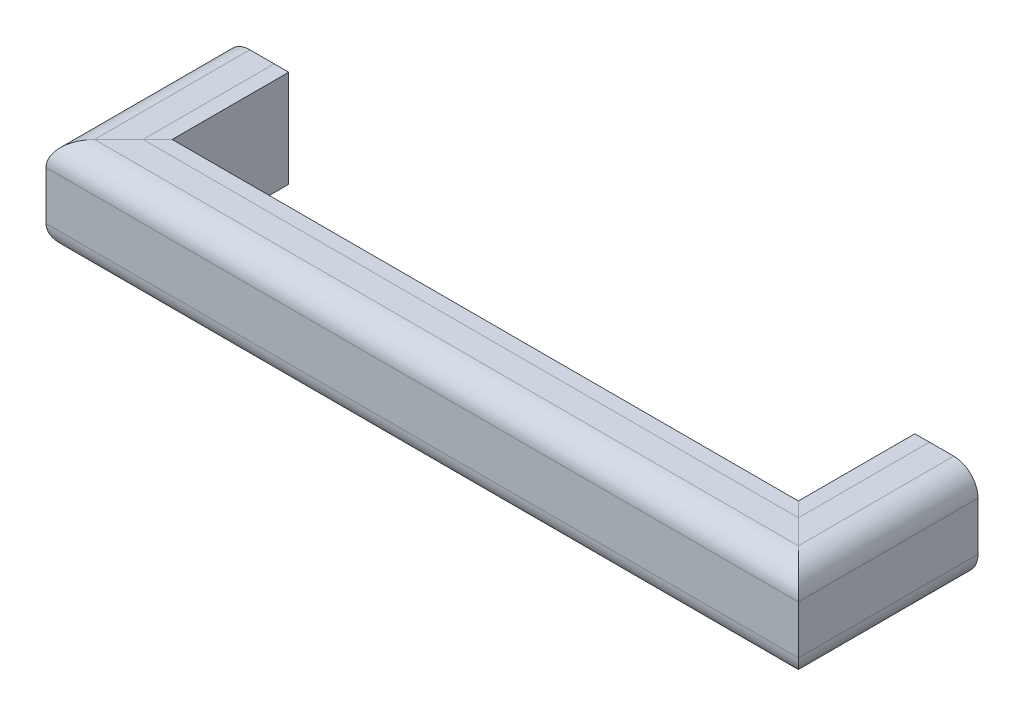
ISO-10303-21;
HEADER;
FILE_DESCRIPTION(('STEP AP214'),'2;1');
FILE_NAME('part.step','',(''),(''),'','','');
FILE_SCHEMA(('AUTOMOTIVE_DESIGN { 1 0 10303 214 1 1 1 1 }'));
ENDSEC;
DATA;
#1=APPLICATION_CONTEXT('core data for automotive mechanical design processes');
#2=APPLICATION_PROTOCOL_DEFINITION('international standard','automotive_design',2000,#1);
#3=PRODUCT_CONTEXT('',#1,'mechanical');
#4=PRODUCT('Part','Part','',(#3));
#5=PRODUCT_RELATED_PRODUCT_CATEGORY('part','',(#4));
#6=PRODUCT_DEFINITION_FORMATION('','',#4);
#7=PRODUCT_DEFINITION_CONTEXT('part definition',#1,'design');
#8=PRODUCT_DEFINITION('design','',#6,#7);
#9=PRODUCT_DEFINITION_SHAPE('','',#8);
#10=(LENGTH_UNIT() NAMED_UNIT(*) SI_UNIT(.MILLI.,.METRE.));
#11=(NAMED_UNIT(*) PLANE_ANGLE_UNIT() SI_UNIT($,.RADIAN.));
#12=(NAMED_UNIT(*) SI_UNIT($,.STERADIAN.) SOLID_ANGLE_UNIT());
#13=UNCERTAINTY_MEASURE_WITH_UNIT(LENGTH_MEASURE(1.E-05),#10,'distance_accuracy_value','');
#14=(GEOMETRIC_REPRESENTATION_CONTEXT(3) GLOBAL_UNCERTAINTY_ASSIGNED_CONTEXT((#13)) GLOBAL_UNIT_ASSIGNED_CONTEXT((#10,
#11,#12)) REPRESENTATION_CONTEXT('',''));
#15=CARTESIAN_POINT('',(0.,0.,0.));
#16=DIRECTION('',(0.,0.,1.));
#17=DIRECTION('',(1.,0.,0.));
#18=AXIS2_PLACEMENT_3D('',#15,#16,#17);
#19=CARTESIAN_POINT('',(460.375,95.2500000000001,0.));
#20=DIRECTION('',(0.,0.,-1.));
#21=DIRECTION('',(-1.,0.,0.));
#22=AXIS2_PLACEMENT_3D('',#19,#20,#21);
#23=PLANE('',#22);
#24=DIRECTION('',(0.,1.,0.));
#25=VECTOR('',#24,1.);
#26=CARTESIAN_POINT('',(409.575,0.,0.));
#27=LINE('',#26,#25);
#28=CARTESIAN_POINT('',(409.575,0.,0.));
#29=VERTEX_POINT('',#28);
#30=CARTESIAN_POINT('',(409.575,127.,0.));
#31=VERTEX_POINT('',#30);
#32=EDGE_CURVE('E104',#29,#31,#27,.T.);
#33=ORIENTED_EDGE('',*,*,#32,.T.);
#34=DIRECTION('',(1.,0.,0.));
#35=VECTOR('',#34,1.);
#36=CARTESIAN_POINT('',(409.575,127.,0.));
#37=LINE('',#36,#35);
#38=CARTESIAN_POINT('',(428.625,127.,0.));
#39=VERTEX_POINT('',#38);
#40=EDGE_CURVE('E123',#31,#39,#37,.T.);
#41=ORIENTED_EDGE('',*,*,#40,.T.);
#42=DIRECTION('',(1.,0.,0.));
#43=VECTOR('',#42,1.);
#44=CARTESIAN_POINT('',(428.625,127.,0.));
#45=LINE('',#44,#43);
#46=CARTESIAN_POINT('',(460.375,127.,0.));
#47=VERTEX_POINT('',#46);
#48=EDGE_CURVE('E150',#39,#47,#45,.T.);
#49=ORIENTED_EDGE('',*,*,#48,.T.);
#50=CARTESIAN_POINT('',(460.375,95.2500000000001,0.));
#51=DIRECTION('',(0.,0.,-1.));
#52=DIRECTION('',(-1.,0.,0.));
#53=AXIS2_PLACEMENT_3D('',#50,#51,#52);
#54=CIRCLE('',#53,31.75);
#55=CARTESIAN_POINT('',(492.125,95.2500000000001,0.));
#56=VERTEX_POINT('',#55);
#57=EDGE_CURVE('E152',#47,#56,#54,.T.);
#58=ORIENTED_EDGE('',*,*,#57,.T.);
#59=DIRECTION('',(0.,-1.,0.));
#60=VECTOR('',#59,1.);
#61=CARTESIAN_POINT('',(492.125,95.2500000000001,0.));
#62=LINE('',#61,#60);
#63=CARTESIAN_POINT('',(492.125,31.7500000000001,0.));
#64=VERTEX_POINT('',#63);
#65=EDGE_CURVE('E154',#56,#64,#62,.T.);
#66=ORIENTED_EDGE('',*,*,#65,.T.);
#67=CARTESIAN_POINT('',(460.375,31.7500000000001,0.));
#68=DIRECTION('',(0.,0.,-1.));
#69=DIRECTION('',(-1.,0.,0.));
#70=AXIS2_PLACEMENT_3D('',#67,#68,#69);
#71=CIRCLE('',#70,31.75);
#72=CARTESIAN_POINT('',(460.375,0.,0.));
#73=VERTEX_POINT('',#72);
#74=EDGE_CURVE('E156',#64,#73,#71,.T.);
#75=ORIENTED_EDGE('',*,*,#74,.T.);
#76=DIRECTION('',(-1.,0.,0.));
#77=VECTOR('',#76,1.);
#78=CARTESIAN_POINT('',(460.375,0.,0.));
#79=LINE('',#78,#77);
#80=CARTESIAN_POINT('',(428.625,0.,0.));
#81=VERTEX_POINT('',#80);
#82=EDGE_CURVE('E109',#73,#81,#79,.T.);
#83=ORIENTED_EDGE('',*,*,#82,.T.);
#84=DIRECTION('',(-1.,0.,0.));
#85=VECTOR('',#84,1.);
#86=CARTESIAN_POINT('',(409.575,0.,0.));
#87=LINE('',#86,#85);
#88=EDGE_CURVE('E107',#81,#29,#87,.T.);
#89=ORIENTED_EDGE('',*,*,#88,.T.);
#90=EDGE_LOOP('',(#33,#41,#49,#58,#66,#75,#83,#89));
#91=FACE_BOUND('',#90,.T.);
#92=ADVANCED_FACE('F34',(#91),#23,.T.);
#93=CARTESIAN_POINT('',(-460.375,95.2500000000001,0.));
#94=DIRECTION('',(0.,0.,1.));
#95=DIRECTION('',(1.,0.,0.));
#96=AXIS2_PLACEMENT_3D('',#93,#94,#95);
#97=PLANE('',#96);
#98=DIRECTION('',(0.,1.,0.));
#99=VECTOR('',#98,1.);
#100=CARTESIAN_POINT('',(-409.575,0.,0.));
#101=LINE('',#100,#99);
#102=CARTESIAN_POINT('',(-409.575,0.,0.));
#103=VERTEX_POINT('',#102);
#104=CARTESIAN_POINT('',(-409.575,127.,0.));
#105=VERTEX_POINT('',#104);
#106=EDGE_CURVE('E199',#103,#105,#101,.T.);
#107=ORIENTED_EDGE('',*,*,#106,.F.);
#108=DIRECTION('',(1.,0.,0.));
#109=VECTOR('',#108,1.);
#110=CARTESIAN_POINT('',(-409.575,0.,0.));
#111=LINE('',#110,#109);
#112=CARTESIAN_POINT('',(-428.625,0.,0.));
#113=VERTEX_POINT('',#112);
#114=EDGE_CURVE('E205',#113,#103,#111,.T.);
#115=ORIENTED_EDGE('',*,*,#114,.F.);
#116=DIRECTION('',(1.,0.,0.));
#117=VECTOR('',#116,1.);
#118=CARTESIAN_POINT('',(-460.375,0.,0.));
#119=LINE('',#118,#117);
#120=CARTESIAN_POINT('',(-460.375,0.,0.));
#121=VERTEX_POINT('',#120);
#122=EDGE_CURVE('E209',#121,#113,#119,.T.);
#123=ORIENTED_EDGE('',*,*,#122,.F.);
#124=CARTESIAN_POINT('',(-460.375,31.7500000000001,0.));
#125=DIRECTION('',(0.,0.,1.));
#126=DIRECTION('',(1.,0.,0.));
#127=AXIS2_PLACEMENT_3D('',#124,#125,#126);
#128=CIRCLE('',#127,31.75);
#129=CARTESIAN_POINT('',(-492.125,31.7500000000001,0.));
#130=VERTEX_POINT('',#129);
#131=EDGE_CURVE('E215',#130,#121,#128,.T.);
#132=ORIENTED_EDGE('',*,*,#131,.F.);
#133=DIRECTION('',(0.,-1.,0.));
#134=VECTOR('',#133,1.);
#135=CARTESIAN_POINT('',(-492.125,95.2500000000001,0.));
#136=LINE('',#135,#134);
#137=CARTESIAN_POINT('',(-492.125,95.2500000000001,0.));
#138=VERTEX_POINT('',#137);
#139=EDGE_CURVE('E221',#138,#130,#136,.T.);
#140=ORIENTED_EDGE('',*,*,#139,.F.);
#141=CARTESIAN_POINT('',(-460.375,95.2500000000001,0.));
#142=DIRECTION('',(0.,0.,1.));
#143=DIRECTION('',(1.,0.,0.));
#144=AXIS2_PLACEMENT_3D('',#141,#142,#143);
#145=CIRCLE('',#144,31.75);
#146=CARTESIAN_POINT('',(-460.375,127.,0.));
#147=VERTEX_POINT('',#146);
#148=EDGE_CURVE('E227',#147,#138,#145,.T.);
#149=ORIENTED_EDGE('',*,*,#148,.F.);
#150=DIRECTION('',(-1.,0.,0.));
#151=VECTOR('',#150,1.);
#152=CARTESIAN_POINT('',(-428.625,127.,0.));
#153=LINE('',#152,#151);
#154=CARTESIAN_POINT('',(-428.625,127.,0.));
#155=VERTEX_POINT('',#154);
#156=EDGE_CURVE('E233',#155,#147,#153,.T.);
#157=ORIENTED_EDGE('',*,*,#156,.F.);
#158=DIRECTION('',(-1.,0.,0.));
#159=VECTOR('',#158,1.);
#160=CARTESIAN_POINT('',(-409.575,127.,0.));
#161=LINE('',#160,#159);
#162=EDGE_CURVE('E239',#105,#155,#161,.T.);
#163=ORIENTED_EDGE('',*,*,#162,.F.);
#164=EDGE_LOOP('',(#107,#115,#123,#132,#140,#149,#157,#163));
#165=FACE_BOUND('',#164,.T.);
#166=ADVANCED_FACE('F284',(#165),#97,.F.);
#167=CARTESIAN_POINT('',(409.575,0.,243.305));
#168=DIRECTION('',(-1.,0.,0.));
#169=DIRECTION('',(0.,0.,1.));
#170=AXIS2_PLACEMENT_3D('',#167,#168,#169);
#171=PLANE('',#170);
#172=DIRECTION('',(0.,-1.,0.));
#173=VECTOR('',#172,1.);
#174=CARTESIAN_POINT('',(409.575,0.,152.4));
#175=LINE('',#174,#173);
#176=CARTESIAN_POINT('',(409.575,127.,152.4));
#177=VERTEX_POINT('',#176);
#178=CARTESIAN_POINT('',(409.575,0.,152.4));
#179=VERTEX_POINT('',#178);
#180=EDGE_CURVE('E159',#177,#179,#175,.T.);
#181=ORIENTED_EDGE('',*,*,#180,.F.);
#182=DIRECTION('',(0.,0.,-1.));
#183=VECTOR('',#182,1.);
#184=CARTESIAN_POINT('',(409.575,127.,243.305));
#185=LINE('',#184,#183);
#186=EDGE_CURVE('E121',#177,#31,#185,.T.);
#187=ORIENTED_EDGE('',*,*,#186,.T.);
#188=ORIENTED_EDGE('',*,*,#32,.F.);
#189=DIRECTION('',(0.,0.,-1.));
#190=VECTOR('',#189,1.);
#191=CARTESIAN_POINT('',(409.575,0.,243.305));
#192=LINE('',#191,#190);
#193=EDGE_CURVE('E37',#179,#29,#192,.T.);
#194=ORIENTED_EDGE('',*,*,#193,.F.);
#195=EDGE_LOOP('',(#181,#187,#188,#194));
#196=FACE_BOUND('',#195,.T.);
#197=ADVANCED_FACE('F118',(#196),#171,.T.);
#198=CARTESIAN_POINT('',(409.575,127.,243.305));
#199=DIRECTION('',(0.,1.,0.));
#200=DIRECTION('',(0.,0.,1.));
#201=AXIS2_PLACEMENT_3D('',#198,#199,#200);
#202=PLANE('',#201);
#203=DIRECTION('',(-0.707106781186548,0.,-0.707106781186548));
#204=VECTOR('',#203,1.);
#205=CARTESIAN_POINT('',(-45.4525,127.,-302.6275));
#206=LINE('',#205,#204);
#207=CARTESIAN_POINT('',(428.625,127.,171.45));
#208=VERTEX_POINT('',#207);
#209=EDGE_CURVE('E196',#208,#177,#206,.T.);
#210=ORIENTED_EDGE('',*,*,#209,.F.);
#211=DIRECTION('',(0.,0.,-1.));
#212=VECTOR('',#211,1.);
#213=CARTESIAN_POINT('',(428.625,127.,243.305));
#214=LINE('',#213,#212);
#215=EDGE_CURVE('E132',#208,#39,#214,.T.);
#216=ORIENTED_EDGE('',*,*,#215,.T.);
#217=ORIENTED_EDGE('',*,*,#40,.F.);
#218=ORIENTED_EDGE('',*,*,#186,.F.);
#219=EDGE_LOOP('',(#210,#216,#217,#218));
#220=FACE_BOUND('',#219,.T.);
#221=ADVANCED_FACE('F354',(#220),#202,.T.);
#222=CARTESIAN_POINT('',(428.625,127.,243.305));
#223=DIRECTION('',(0.,1.,0.));
#224=DIRECTION('',(-1.,0.,0.));
#225=AXIS2_PLACEMENT_3D('',#222,#223,#224);
#226=PLANE('',#225);
#227=DIRECTION('',(-0.707106781186548,0.,-0.707106781186548));
#228=VECTOR('',#227,1.);
#229=CARTESIAN_POINT('',(-35.9274999999999,127.,-293.1025));
#230=LINE('',#229,#228);
#231=CARTESIAN_POINT('',(460.375,127.,203.2));
#232=VERTEX_POINT('',#231);
#233=EDGE_CURVE('E193',#232,#208,#230,.T.);
#234=ORIENTED_EDGE('',*,*,#233,.F.);
#235=DIRECTION('',(0.,0.,-1.));
#236=VECTOR('',#235,1.);
#237=CARTESIAN_POINT('',(460.375,127.,243.305));
#238=LINE('',#237,#236);
#239=EDGE_CURVE('E134',#232,#47,#238,.T.);
#240=ORIENTED_EDGE('',*,*,#239,.T.);
#241=ORIENTED_EDGE('',*,*,#48,.F.);
#242=ORIENTED_EDGE('',*,*,#215,.F.);
#243=EDGE_LOOP('',(#234,#240,#241,#242));
#244=FACE_BOUND('',#243,.T.);
#245=ADVANCED_FACE('F360',(#244),#226,.T.);
#246=CARTESIAN_POINT('',(460.375,95.2500000000001,243.305));
#247=DIRECTION('',(0.,0.,-1.));
#248=DIRECTION('',(-1.,0.,0.));
#249=AXIS2_PLACEMENT_3D('',#246,#247,#248);
#250=CYLINDRICAL_SURFACE('',#249,31.75);
#251=CARTESIAN_POINT('',(460.375,95.2500000000001,203.2));
#252=DIRECTION('',(0.707106781186547,0.,-0.707106781186547));
#253=DIRECTION('',(0.707106781186548,0.,0.707106781186548));
#254=AXIS2_PLACEMENT_3D('',#251,#252,#253);
#255=ELLIPSE('',#254,44.9012806053458,31.75);
#256=CARTESIAN_POINT('',(492.125,95.2500000000001,234.95));
#257=VERTEX_POINT('',#256);
#258=EDGE_CURVE('E190',#257,#232,#255,.F.);
#259=ORIENTED_EDGE('',*,*,#258,.F.);
#260=DIRECTION('',(0.,0.,-1.));
#261=VECTOR('',#260,1.);
#262=CARTESIAN_POINT('',(492.125,95.2500000000001,243.305));
#263=LINE('',#262,#261);
#264=EDGE_CURVE('E139',#257,#56,#263,.T.);
#265=ORIENTED_EDGE('',*,*,#264,.T.);
#266=ORIENTED_EDGE('',*,*,#57,.F.);
#267=ORIENTED_EDGE('',*,*,#239,.F.);
#268=EDGE_LOOP('',(#259,#265,#266,#267));
#269=FACE_BOUND('',#268,.T.);
#270=ADVANCED_FACE('F364',(#269),#250,.T.);
#271=CARTESIAN_POINT('',(492.125,95.2500000000001,243.305));
#272=DIRECTION('',(1.,0.,0.));
#273=DIRECTION('',(0.,0.,-1.));
#274=AXIS2_PLACEMENT_3D('',#271,#272,#273);
#275=PLANE('',#274);
#276=DIRECTION('',(0.,1.,0.));
#277=VECTOR('',#276,1.);
#278=CARTESIAN_POINT('',(492.125,95.2500000000001,234.95));
#279=LINE('',#278,#277);
#280=CARTESIAN_POINT('',(492.125,31.7500000000001,234.95));
#281=VERTEX_POINT('',#280);
#282=EDGE_CURVE('E187',#281,#257,#279,.T.);
#283=ORIENTED_EDGE('',*,*,#282,.F.);
#284=DIRECTION('',(0.,0.,-1.));
#285=VECTOR('',#284,1.);
#286=CARTESIAN_POINT('',(492.125,31.7500000000001,243.305));
#287=LINE('',#286,#285);
#288=EDGE_CURVE('E142',#281,#64,#287,.T.);
#289=ORIENTED_EDGE('',*,*,#288,.T.);
#290=ORIENTED_EDGE('',*,*,#65,.F.);
#291=ORIENTED_EDGE('',*,*,#264,.F.);
#292=EDGE_LOOP('',(#283,#289,#290,#291));
#293=FACE_BOUND('',#292,.T.);
#294=ADVANCED_FACE('F369',(#293),#275,.T.);
#295=CARTESIAN_POINT('',(460.375,31.7500000000001,243.305));
#296=DIRECTION('',(0.,0.,-1.));
#297=DIRECTION('',(-1.,0.,0.));
#298=AXIS2_PLACEMENT_3D('',#295,#296,#297);
#299=CYLINDRICAL_SURFACE('',#298,31.75);
#300=CARTESIAN_POINT('',(460.375,31.7500000000001,203.2));
#301=DIRECTION('',(0.707106781186547,0.,-0.707106781186547));
#302=DIRECTION('',(0.707106781186548,0.,0.707106781186548));
#303=AXIS2_PLACEMENT_3D('',#300,#301,#302);
#304=ELLIPSE('',#303,44.9012806053458,31.75);
#305=CARTESIAN_POINT('',(460.375,0.,203.2));
#306=VERTEX_POINT('',#305);
#307=EDGE_CURVE('E184',#306,#281,#304,.F.);
#308=ORIENTED_EDGE('',*,*,#307,.F.);
#309=DIRECTION('',(0.,0.,-1.));
#310=VECTOR('',#309,1.);
#311=CARTESIAN_POINT('',(460.375,0.,243.305));
#312=LINE('',#311,#310);
#313=EDGE_CURVE('E145',#306,#73,#312,.T.);
#314=ORIENTED_EDGE('',*,*,#313,.T.);
#315=ORIENTED_EDGE('',*,*,#74,.F.);
#316=ORIENTED_EDGE('',*,*,#288,.F.);
#317=EDGE_LOOP('',(#308,#314,#315,#316));
#318=FACE_BOUND('',#317,.T.);
#319=ADVANCED_FACE('F372',(#318),#299,.T.);
#320=CARTESIAN_POINT('',(460.375,0.,243.305));
#321=DIRECTION('',(0.,-1.,0.));
#322=DIRECTION('',(1.,0.,0.));
#323=AXIS2_PLACEMENT_3D('',#320,#321,#322);
#324=PLANE('',#323);
#325=DIRECTION('',(0.707106781186548,0.,0.707106781186548));
#326=VECTOR('',#325,1.);
#327=CARTESIAN_POINT('',(-20.0525,0.,-277.2275));
#328=LINE('',#327,#326);
#329=CARTESIAN_POINT('',(428.625,0.,171.45));
#330=VERTEX_POINT('',#329);
#331=EDGE_CURVE('E181',#330,#306,#328,.T.);
#332=ORIENTED_EDGE('',*,*,#331,.F.);
#333=DIRECTION('',(0.,0.,-1.));
#334=VECTOR('',#333,1.);
#335=CARTESIAN_POINT('',(428.625,0.,243.305));
#336=LINE('',#335,#334);
#337=EDGE_CURVE('E122',#330,#81,#336,.T.);
#338=ORIENTED_EDGE('',*,*,#337,.T.);
#339=ORIENTED_EDGE('',*,*,#82,.F.);
#340=ORIENTED_EDGE('',*,*,#313,.F.);
#341=EDGE_LOOP('',(#332,#338,#339,#340));
#342=FACE_BOUND('',#341,.T.);
#343=ADVANCED_FACE('F349',(#342),#324,.T.);
#344=CARTESIAN_POINT('',(409.575,0.,243.305));
#345=DIRECTION('',(0.,-1.,0.));
#346=DIRECTION('',(1.,0.,0.));
#347=AXIS2_PLACEMENT_3D('',#344,#345,#346);
#348=PLANE('',#347);
#349=DIRECTION('',(0.707106781186548,0.,0.707106781186548));
#350=VECTOR('',#349,1.);
#351=CARTESIAN_POINT('',(-45.4525,2.01808419840262E-12,-302.6275));
#352=LINE('',#351,#350);
#353=EDGE_CURVE('E127',#179,#330,#352,.T.);
#354=ORIENTED_EDGE('',*,*,#353,.F.);
#355=ORIENTED_EDGE('',*,*,#193,.T.);
#356=ORIENTED_EDGE('',*,*,#88,.F.);
#357=ORIENTED_EDGE('',*,*,#337,.F.);
#358=EDGE_LOOP('',(#354,#355,#356,#357));
#359=FACE_BOUND('',#358,.T.);
#360=ADVANCED_FACE('F125',(#359),#348,.T.);
#361=CARTESIAN_POINT('',(-500.48,0.,152.4));
#362=DIRECTION('',(0.,-1.,0.));
#363=DIRECTION('',(0.,0.,-1.));
#364=AXIS2_PLACEMENT_3D('',#361,#362,#363);
#365=PLANE('',#364);
#366=DIRECTION('',(1.,0.,0.));
#367=VECTOR('',#366,1.);
#368=CARTESIAN_POINT('',(-500.48,0.,152.4));
#369=LINE('',#368,#367);
#370=CARTESIAN_POINT('',(-409.575,0.,152.4));
#371=VERTEX_POINT('',#370);
#372=EDGE_CURVE('E161',#371,#179,#369,.T.);
#373=ORIENTED_EDGE('',*,*,#372,.T.);
#374=ORIENTED_EDGE('',*,*,#353,.T.);
#375=DIRECTION('',(1.,0.,0.));
#376=VECTOR('',#375,1.);
#377=CARTESIAN_POINT('',(-500.48,0.,171.45));
#378=LINE('',#377,#376);
#379=CARTESIAN_POINT('',(-428.625,0.,171.45));
#380=VERTEX_POINT('',#379);
#381=EDGE_CURVE('E128',#380,#330,#378,.T.);
#382=ORIENTED_EDGE('',*,*,#381,.F.);
#383=DIRECTION('',(-0.707106781186548,0.,0.707106781186548));
#384=VECTOR('',#383,1.);
#385=CARTESIAN_POINT('',(-333.375,4.03479900114781E-13,76.2));
#386=LINE('',#385,#384);
#387=EDGE_CURVE('E203',#371,#380,#386,.T.);
#388=ORIENTED_EDGE('',*,*,#387,.F.);
#389=EDGE_LOOP('',(#373,#374,#382,#388));
#390=FACE_BOUND('',#389,.T.);
#391=ADVANCED_FACE('F350',(#390),#365,.T.);
#392=CARTESIAN_POINT('',(-500.48,0.,203.2));
#393=DIRECTION('',(0.,-1.,0.));
#394=DIRECTION('',(0.,0.,-1.));
#395=AXIS2_PLACEMENT_3D('',#392,#393,#394);
#396=PLANE('',#395);
#397=ORIENTED_EDGE('',*,*,#381,.T.);
#398=ORIENTED_EDGE('',*,*,#331,.T.);
#399=DIRECTION('',(1.,0.,0.));
#400=VECTOR('',#399,1.);
#401=CARTESIAN_POINT('',(-500.48,0.,203.2));
#402=LINE('',#401,#400);
#403=CARTESIAN_POINT('',(-460.375,0.,203.2));
#404=VERTEX_POINT('',#403);
#405=EDGE_CURVE('E130',#404,#306,#402,.T.);
#406=ORIENTED_EDGE('',*,*,#405,.F.);
#407=DIRECTION('',(-0.707106781186548,0.,0.707106781186548));
#408=VECTOR('',#407,1.);
#409=CARTESIAN_POINT('',(-358.775,0.,101.6));
#410=LINE('',#409,#408);
#411=EDGE_CURVE('E253',#380,#404,#410,.T.);
#412=ORIENTED_EDGE('',*,*,#411,.F.);
#413=EDGE_LOOP('',(#397,#398,#406,#412));
#414=FACE_BOUND('',#413,.T.);
#415=ADVANCED_FACE('F346',(#414),#396,.T.);
#416=CARTESIAN_POINT('',(-500.48,31.7500000000001,203.2));
#417=DIRECTION('',(1.,0.,0.));
#418=DIRECTION('',(0.,0.,-1.));
#419=AXIS2_PLACEMENT_3D('',#416,#417,#418);
#420=CYLINDRICAL_SURFACE('',#419,31.75);
#421=ORIENTED_EDGE('',*,*,#405,.T.);
#422=ORIENTED_EDGE('',*,*,#307,.T.);
#423=DIRECTION('',(1.,0.,0.));
#424=VECTOR('',#423,1.);
#425=CARTESIAN_POINT('',(-500.48,31.7500000000001,234.95));
#426=LINE('',#425,#424);
#427=CARTESIAN_POINT('',(-492.125,31.7500000000001,234.95));
#428=VERTEX_POINT('',#427);
#429=EDGE_CURVE('E175',#428,#281,#426,.T.);
#430=ORIENTED_EDGE('',*,*,#429,.F.);
#431=CARTESIAN_POINT('',(-460.375,31.7500000000001,203.2));
#432=DIRECTION('',(0.707106781186547,0.,0.707106781186547));
#433=DIRECTION('',(-0.707106781186548,0.,0.707106781186548));
#434=AXIS2_PLACEMENT_3D('',#431,#432,#433);
#435=ELLIPSE('',#434,44.9012806053458,31.75);
#436=EDGE_CURVE('E256',#404,#428,#435,.F.);
#437=ORIENTED_EDGE('',*,*,#436,.F.);
#438=EDGE_LOOP('',(#421,#422,#430,#437));
#439=FACE_BOUND('',#438,.T.);
#440=ADVANCED_FACE('F344',(#439),#420,.T.);
#441=CARTESIAN_POINT('',(-500.48,95.2500000000001,234.95));
#442=DIRECTION('',(0.,0.,1.));
#443=DIRECTION('',(1.,0.,0.));
#444=AXIS2_PLACEMENT_3D('',#441,#442,#443);
#445=PLANE('',#444);
#446=ORIENTED_EDGE('',*,*,#429,.T.);
#447=ORIENTED_EDGE('',*,*,#282,.T.);
#448=DIRECTION('',(1.,0.,0.));
#449=VECTOR('',#448,1.);
#450=CARTESIAN_POINT('',(-500.48,95.2500000000001,234.95));
#451=LINE('',#450,#449);
#452=CARTESIAN_POINT('',(-492.125,95.2500000000001,234.95));
#453=VERTEX_POINT('',#452);
#454=EDGE_CURVE('E172',#453,#257,#451,.T.);
#455=ORIENTED_EDGE('',*,*,#454,.F.);
#456=DIRECTION('',(0.,1.,0.));
#457=VECTOR('',#456,1.);
#458=CARTESIAN_POINT('',(-492.125,95.2500000000001,234.95));
#459=LINE('',#458,#457);
#460=EDGE_CURVE('E259',#428,#453,#459,.T.);
#461=ORIENTED_EDGE('',*,*,#460,.F.);
#462=EDGE_LOOP('',(#446,#447,#455,#461));
#463=FACE_BOUND('',#462,.T.);
#464=ADVANCED_FACE('F320',(#463),#445,.T.);
#465=CARTESIAN_POINT('',(-500.48,95.2500000000001,203.2));
#466=DIRECTION('',(1.,0.,0.));
#467=DIRECTION('',(0.,0.,-1.));
#468=AXIS2_PLACEMENT_3D('',#465,#466,#467);
#469=CYLINDRICAL_SURFACE('',#468,31.75);
#470=ORIENTED_EDGE('',*,*,#454,.T.);
#471=ORIENTED_EDGE('',*,*,#258,.T.);
#472=DIRECTION('',(1.,0.,0.));
#473=VECTOR('',#472,1.);
#474=CARTESIAN_POINT('',(-500.48,127.,203.2));
#475=LINE('',#474,#473);
#476=CARTESIAN_POINT('',(-460.375,127.,203.2));
#477=VERTEX_POINT('',#476);
#478=EDGE_CURVE('E169',#477,#232,#475,.T.);
#479=ORIENTED_EDGE('',*,*,#478,.F.);
#480=CARTESIAN_POINT('',(-460.375,95.2500000000001,203.2));
#481=DIRECTION('',(0.707106781186547,0.,0.707106781186547));
#482=DIRECTION('',(-0.707106781186548,0.,0.707106781186548));
#483=AXIS2_PLACEMENT_3D('',#480,#481,#482);
#484=ELLIPSE('',#483,44.9012806053458,31.75);
#485=EDGE_CURVE('E262',#453,#477,#484,.F.);
#486=ORIENTED_EDGE('',*,*,#485,.F.);
#487=EDGE_LOOP('',(#470,#471,#479,#486));
#488=FACE_BOUND('',#487,.T.);
#489=ADVANCED_FACE('F317',(#488),#469,.T.);
#490=CARTESIAN_POINT('',(-500.48,127.,171.45));
#491=DIRECTION('',(0.,1.,0.));
#492=DIRECTION('',(0.,0.,1.));
#493=AXIS2_PLACEMENT_3D('',#490,#491,#492);
#494=PLANE('',#493);
#495=ORIENTED_EDGE('',*,*,#478,.T.);
#496=ORIENTED_EDGE('',*,*,#233,.T.);
#497=DIRECTION('',(1.,0.,0.));
#498=VECTOR('',#497,1.);
#499=CARTESIAN_POINT('',(-500.48,127.,171.45));
#500=LINE('',#499,#498);
#501=CARTESIAN_POINT('',(-428.625,127.,171.45));
#502=VERTEX_POINT('',#501);
#503=EDGE_CURVE('E167',#502,#208,#500,.T.);
#504=ORIENTED_EDGE('',*,*,#503,.F.);
#505=DIRECTION('',(0.707106781186548,0.,-0.707106781186548));
#506=VECTOR('',#505,1.);
#507=CARTESIAN_POINT('',(-342.9,127.,85.725));
#508=LINE('',#507,#506);
#509=EDGE_CURVE('E43',#477,#502,#508,.T.);
#510=ORIENTED_EDGE('',*,*,#509,.F.);
#511=EDGE_LOOP('',(#495,#496,#504,#510));
#512=FACE_BOUND('',#511,.T.);
#513=ADVANCED_FACE('F357',(#512),#494,.T.);
#514=CARTESIAN_POINT('',(-500.48,127.,152.4));
#515=DIRECTION('',(0.,1.,0.));
#516=DIRECTION('',(0.,0.,1.));
#517=AXIS2_PLACEMENT_3D('',#514,#515,#516);
#518=PLANE('',#517);
#519=ORIENTED_EDGE('',*,*,#503,.T.);
#520=ORIENTED_EDGE('',*,*,#209,.T.);
#521=DIRECTION('',(1.,0.,0.));
#522=VECTOR('',#521,1.);
#523=CARTESIAN_POINT('',(-500.48,127.,152.4));
#524=LINE('',#523,#522);
#525=CARTESIAN_POINT('',(-409.575,127.,152.4));
#526=VERTEX_POINT('',#525);
#527=EDGE_CURVE('E164',#526,#177,#524,.T.);
#528=ORIENTED_EDGE('',*,*,#527,.F.);
#529=DIRECTION('',(0.707106781186548,0.,-0.707106781186548));
#530=VECTOR('',#529,1.);
#531=CARTESIAN_POINT('',(-333.375,127.,76.2));
#532=LINE('',#531,#530);
#533=EDGE_CURVE('E11',#502,#526,#532,.T.);
#534=ORIENTED_EDGE('',*,*,#533,.F.);
#535=EDGE_LOOP('',(#519,#520,#528,#534));
#536=FACE_BOUND('',#535,.T.);
#537=ADVANCED_FACE('F356',(#536),#518,.T.);
#538=CARTESIAN_POINT('',(-500.48,0.,152.4));
#539=DIRECTION('',(0.,0.,-1.));
#540=DIRECTION('',(-1.,0.,0.));
#541=AXIS2_PLACEMENT_3D('',#538,#539,#540);
#542=PLANE('',#541);
#543=ORIENTED_EDGE('',*,*,#527,.T.);
#544=ORIENTED_EDGE('',*,*,#180,.T.);
#545=ORIENTED_EDGE('',*,*,#372,.F.);
#546=DIRECTION('',(0.,-1.,0.));
#547=VECTOR('',#546,1.);
#548=CARTESIAN_POINT('',(-409.575,0.,152.4));
#549=LINE('',#548,#547);
#550=EDGE_CURVE('E200',#526,#371,#549,.T.);
#551=ORIENTED_EDGE('',*,*,#550,.F.);
#552=EDGE_LOOP('',(#543,#544,#545,#551));
#553=FACE_BOUND('',#552,.T.);
#554=ADVANCED_FACE('F352',(#553),#542,.T.);
#555=CARTESIAN_POINT('',(-409.575,0.,0.));
#556=DIRECTION('',(0.,-1.,0.));
#557=DIRECTION('',(1.,0.,0.));
#558=AXIS2_PLACEMENT_3D('',#555,#556,#557);
#559=PLANE('',#558);
#560=DIRECTION('',(0.,0.,1.));
#561=VECTOR('',#560,1.);
#562=CARTESIAN_POINT('',(-409.575,0.,0.));
#563=LINE('',#562,#561);
#564=EDGE_CURVE('E208',#103,#371,#563,.T.);
#565=ORIENTED_EDGE('',*,*,#564,.T.);
#566=ORIENTED_EDGE('',*,*,#387,.T.);
#567=DIRECTION('',(0.,0.,1.));
#568=VECTOR('',#567,1.);
#569=CARTESIAN_POINT('',(-428.625,0.,0.));
#570=LINE('',#569,#568);
#571=EDGE_CURVE('E204',#113,#380,#570,.T.);
#572=ORIENTED_EDGE('',*,*,#571,.F.);
#573=ORIENTED_EDGE('',*,*,#114,.T.);
#574=EDGE_LOOP('',(#565,#566,#572,#573));
#575=FACE_BOUND('',#574,.T.);
#576=ADVANCED_FACE('F295',(#575),#559,.T.);
#577=CARTESIAN_POINT('',(-460.375,0.,0.));
#578=DIRECTION('',(0.,-1.,0.));
#579=DIRECTION('',(1.,0.,0.));
#580=AXIS2_PLACEMENT_3D('',#577,#578,#579);
#581=PLANE('',#580);
#582=ORIENTED_EDGE('',*,*,#571,.T.);
#583=ORIENTED_EDGE('',*,*,#411,.T.);
#584=DIRECTION('',(0.,0.,1.));
#585=VECTOR('',#584,1.);
#586=CARTESIAN_POINT('',(-460.375,0.,0.));
#587=LINE('',#586,#585);
#588=EDGE_CURVE('E212',#121,#404,#587,.T.);
#589=ORIENTED_EDGE('',*,*,#588,.F.);
#590=ORIENTED_EDGE('',*,*,#122,.T.);
#591=EDGE_LOOP('',(#582,#583,#589,#590));
#592=FACE_BOUND('',#591,.T.);
#593=ADVANCED_FACE('F339',(#592),#581,.T.);
#594=CARTESIAN_POINT('',(-460.375,31.7500000000001,0.));
#595=DIRECTION('',(0.,0.,1.));
#596=DIRECTION('',(1.,0.,0.));
#597=AXIS2_PLACEMENT_3D('',#594,#595,#596);
#598=CYLINDRICAL_SURFACE('',#597,31.75);
#599=ORIENTED_EDGE('',*,*,#588,.T.);
#600=ORIENTED_EDGE('',*,*,#436,.T.);
#601=DIRECTION('',(0.,0.,1.));
#602=VECTOR('',#601,1.);
#603=CARTESIAN_POINT('',(-492.125,31.7500000000001,0.));
#604=LINE('',#603,#602);
#605=EDGE_CURVE('E218',#130,#428,#604,.T.);
#606=ORIENTED_EDGE('',*,*,#605,.F.);
#607=ORIENTED_EDGE('',*,*,#131,.T.);
#608=EDGE_LOOP('',(#599,#600,#606,#607));
#609=FACE_BOUND('',#608,.T.);
#610=ADVANCED_FACE('F341',(#609),#598,.T.);
#611=CARTESIAN_POINT('',(-492.125,95.2500000000001,0.));
#612=DIRECTION('',(-1.,0.,0.));
#613=DIRECTION('',(0.,0.,1.));
#614=AXIS2_PLACEMENT_3D('',#611,#612,#613);
#615=PLANE('',#614);
#616=ORIENTED_EDGE('',*,*,#605,.T.);
#617=ORIENTED_EDGE('',*,*,#460,.T.);
#618=DIRECTION('',(0.,0.,1.));
#619=VECTOR('',#618,1.);
#620=CARTESIAN_POINT('',(-492.125,95.2500000000001,0.));
#621=LINE('',#620,#619);
#622=EDGE_CURVE('E224',#138,#453,#621,.T.);
#623=ORIENTED_EDGE('',*,*,#622,.F.);
#624=ORIENTED_EDGE('',*,*,#139,.T.);
#625=EDGE_LOOP('',(#616,#617,#623,#624));
#626=FACE_BOUND('',#625,.T.);
#627=ADVANCED_FACE('F324',(#626),#615,.T.);
#628=CARTESIAN_POINT('',(-460.375,95.2500000000001,0.));
#629=DIRECTION('',(0.,0.,1.));
#630=DIRECTION('',(1.,0.,0.));
#631=AXIS2_PLACEMENT_3D('',#628,#629,#630);
#632=CYLINDRICAL_SURFACE('',#631,31.75);
#633=ORIENTED_EDGE('',*,*,#622,.T.);
#634=ORIENTED_EDGE('',*,*,#485,.T.);
#635=DIRECTION('',(0.,0.,1.));
#636=VECTOR('',#635,1.);
#637=CARTESIAN_POINT('',(-460.375,127.,0.));
#638=LINE('',#637,#636);
#639=EDGE_CURVE('E230',#147,#477,#638,.T.);
#640=ORIENTED_EDGE('',*,*,#639,.F.);
#641=ORIENTED_EDGE('',*,*,#148,.T.);
#642=EDGE_LOOP('',(#633,#634,#640,#641));
#643=FACE_BOUND('',#642,.T.);
#644=ADVANCED_FACE('F327',(#643),#632,.T.);
#645=CARTESIAN_POINT('',(-428.625,127.,0.));
#646=DIRECTION('',(0.,1.,0.));
#647=DIRECTION('',(-1.,0.,0.));
#648=AXIS2_PLACEMENT_3D('',#645,#646,#647);
#649=PLANE('',#648);
#650=ORIENTED_EDGE('',*,*,#639,.T.);
#651=ORIENTED_EDGE('',*,*,#509,.T.);
#652=DIRECTION('',(0.,0.,1.));
#653=VECTOR('',#652,1.);
#654=CARTESIAN_POINT('',(-428.625,127.,0.));
#655=LINE('',#654,#653);
#656=EDGE_CURVE('E236',#155,#502,#655,.T.);
#657=ORIENTED_EDGE('',*,*,#656,.F.);
#658=ORIENTED_EDGE('',*,*,#156,.T.);
#659=EDGE_LOOP('',(#650,#651,#657,#658));
#660=FACE_BOUND('',#659,.T.);
#661=ADVANCED_FACE('F268',(#660),#649,.T.);
#662=CARTESIAN_POINT('',(-409.575,127.,0.));
#663=DIRECTION('',(0.,1.,0.));
#664=DIRECTION('',(0.,0.,1.));
#665=AXIS2_PLACEMENT_3D('',#662,#663,#664);
#666=PLANE('',#665);
#667=ORIENTED_EDGE('',*,*,#656,.T.);
#668=ORIENTED_EDGE('',*,*,#533,.T.);
#669=DIRECTION('',(0.,0.,1.));
#670=VECTOR('',#669,1.);
#671=CARTESIAN_POINT('',(-409.575,127.,0.));
#672=LINE('',#671,#670);
#673=EDGE_CURVE('E242',#105,#526,#672,.T.);
#674=ORIENTED_EDGE('',*,*,#673,.F.);
#675=ORIENTED_EDGE('',*,*,#162,.T.);
#676=EDGE_LOOP('',(#667,#668,#674,#675));
#677=FACE_BOUND('',#676,.T.);
#678=ADVANCED_FACE('F274',(#677),#666,.T.);
#679=CARTESIAN_POINT('',(-409.575,0.,0.));
#680=DIRECTION('',(1.,0.,0.));
#681=DIRECTION('',(0.,0.,-1.));
#682=AXIS2_PLACEMENT_3D('',#679,#680,#681);
#683=PLANE('',#682);
#684=ORIENTED_EDGE('',*,*,#673,.T.);
#685=ORIENTED_EDGE('',*,*,#550,.T.);
#686=ORIENTED_EDGE('',*,*,#564,.F.);
#687=ORIENTED_EDGE('',*,*,#106,.T.);
#688=EDGE_LOOP('',(#684,#685,#686,#687));
#689=FACE_BOUND('',#688,.T.);
#690=ADVANCED_FACE('F290',(#689),#683,.T.);
#691=CLOSED_SHELL('',(#92,#166,#197,#221,#245,#270,#294,#319,#343,#360,#391,#415,#440,#464,#489,
#513,#537,#554,#576,#593,#610,#627,#644,#661,#678,#690));
#692=MANIFOLD_SOLID_BREP('B2',#691);
#693=ADVANCED_BREP_SHAPE_REPRESENTATION('',(#18,#692),#14);
#694=SHAPE_DEFINITION_REPRESENTATION(#9,#693);
ENDSEC;
END-ISO-10303-21;
